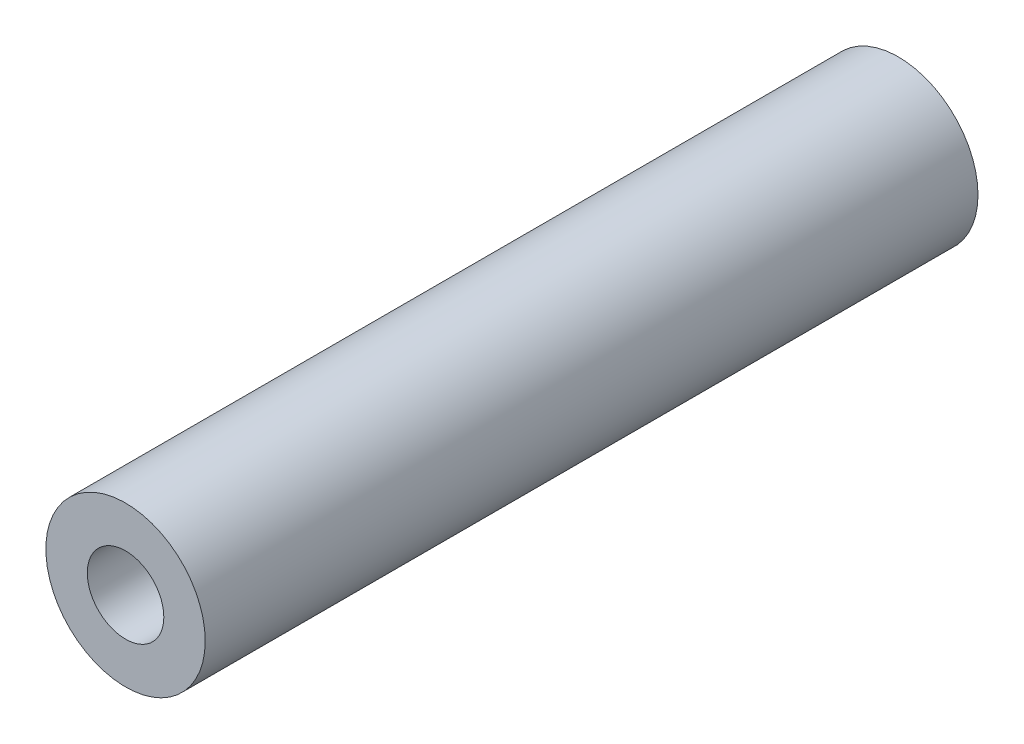
ISO-10303-21;
HEADER;
FILE_DESCRIPTION(('STEP AP214'),'2;1');
FILE_NAME('part.step','',(''),(''),'','','');
FILE_SCHEMA(('AUTOMOTIVE_DESIGN { 1 0 10303 214 1 1 1 1 }'));
ENDSEC;
DATA;
#1=APPLICATION_CONTEXT('core data for automotive mechanical design processes');
#2=APPLICATION_PROTOCOL_DEFINITION('international standard','automotive_design',2000,#1);
#3=PRODUCT_CONTEXT('',#1,'mechanical');
#4=PRODUCT('Part','Part','',(#3));
#5=PRODUCT_RELATED_PRODUCT_CATEGORY('part','',(#4));
#6=PRODUCT_DEFINITION_FORMATION('','',#4);
#7=PRODUCT_DEFINITION_CONTEXT('part definition',#1,'design');
#8=PRODUCT_DEFINITION('design','',#6,#7);
#9=PRODUCT_DEFINITION_SHAPE('','',#8);
#10=(LENGTH_UNIT() NAMED_UNIT(*) SI_UNIT(.MILLI.,.METRE.));
#11=(NAMED_UNIT(*) PLANE_ANGLE_UNIT() SI_UNIT($,.RADIAN.));
#12=(NAMED_UNIT(*) SI_UNIT($,.STERADIAN.) SOLID_ANGLE_UNIT());
#13=UNCERTAINTY_MEASURE_WITH_UNIT(LENGTH_MEASURE(1.E-05),#10,'distance_accuracy_value','');
#14=(GEOMETRIC_REPRESENTATION_CONTEXT(3) GLOBAL_UNCERTAINTY_ASSIGNED_CONTEXT((#13)) GLOBAL_UNIT_ASSIGNED_CONTEXT((#10,
#11,#12)) REPRESENTATION_CONTEXT('',''));
#15=CARTESIAN_POINT('',(0.,0.,0.));
#16=DIRECTION('',(0.,0.,1.));
#17=DIRECTION('',(1.,0.,0.));
#18=AXIS2_PLACEMENT_3D('',#15,#16,#17);
#19=CARTESIAN_POINT('',(-7.72417102966841,4.70986038394415,2.5));
#20=DIRECTION('',(0.,0.,-1.));
#21=DIRECTION('',(-1.,0.,0.));
#22=AXIS2_PLACEMENT_3D('',#19,#20,#21);
#23=CYLINDRICAL_SURFACE('',#22,0.25781);
#24=CARTESIAN_POINT('',(-7.72417102966841,4.70986038394415,2.5));
#25=DIRECTION('',(0.,0.,1.));
#26=DIRECTION('',(1.,0.,0.));
#27=AXIS2_PLACEMENT_3D('',#24,#25,#26);
#28=CIRCLE('',#27,0.25781);
#29=CARTESIAN_POINT('',(-7.46636102966841,4.70986038394415,2.5));
#30=VERTEX_POINT('',#29);
#31=EDGE_CURVE('E10',#30,#30,#28,.T.);
#32=ORIENTED_EDGE('',*,*,#31,.F.);
#33=EDGE_LOOP('',(#32));
#34=FACE_BOUND('',#33,.T.);
#35=CARTESIAN_POINT('',(-7.72417102966841,4.70986038394415,0.));
#36=DIRECTION('',(0.,0.,1.));
#37=DIRECTION('',(1.,0.,0.));
#38=AXIS2_PLACEMENT_3D('',#35,#36,#37);
#39=CIRCLE('',#38,0.25781);
#40=CARTESIAN_POINT('',(-7.46636102966841,4.70986038394415,0.));
#41=VERTEX_POINT('',#40);
#42=EDGE_CURVE('E33',#41,#41,#39,.T.);
#43=ORIENTED_EDGE('',*,*,#42,.T.);
#44=EDGE_LOOP('',(#43));
#45=FACE_BOUND('',#44,.T.);
#46=ADVANCED_FACE('F30',(#34,#45),#23,.T.);
#47=CARTESIAN_POINT('',(-7.72417102966841,4.70986038394415,2.5));
#48=DIRECTION('',(0.,0.,1.));
#49=DIRECTION('',(1.,0.,0.));
#50=AXIS2_PLACEMENT_3D('',#47,#48,#49);
#51=PLANE('',#50);
#52=CARTESIAN_POINT('',(-7.72417102966841,4.70986038394415,2.5));
#53=DIRECTION('',(0.,0.,1.));
#54=DIRECTION('',(1.,0.,0.));
#55=AXIS2_PLACEMENT_3D('',#52,#53,#54);
#56=CIRCLE('',#55,0.123825);
#57=CARTESIAN_POINT('',(-7.60034602966841,4.70986038394415,2.5));
#58=VERTEX_POINT('',#57);
#59=EDGE_CURVE('E42',#58,#58,#56,.T.);
#60=ORIENTED_EDGE('',*,*,#59,.F.);
#61=EDGE_LOOP('',(#60));
#62=FACE_BOUND('',#61,.T.);
#63=ORIENTED_EDGE('',*,*,#31,.T.);
#64=EDGE_LOOP('',(#63));
#65=FACE_BOUND('',#64,.T.);
#66=ADVANCED_FACE('F57',(#62,#65),#51,.T.);
#67=CARTESIAN_POINT('',(-7.72417102966841,4.70986038394415,0.));
#68=DIRECTION('',(0.,0.,1.));
#69=DIRECTION('',(1.,0.,0.));
#70=AXIS2_PLACEMENT_3D('',#67,#68,#69);
#71=PLANE('',#70);
#72=CARTESIAN_POINT('',(-7.72417102966841,4.70986038394415,0.));
#73=DIRECTION('',(0.,0.,1.));
#74=DIRECTION('',(1.,0.,0.));
#75=AXIS2_PLACEMENT_3D('',#72,#73,#74);
#76=CIRCLE('',#75,0.123825);
#77=CARTESIAN_POINT('',(-7.60034602966841,4.70986038394415,0.));
#78=VERTEX_POINT('',#77);
#79=EDGE_CURVE('E40',#78,#78,#76,.T.);
#80=ORIENTED_EDGE('',*,*,#79,.T.);
#81=EDGE_LOOP('',(#80));
#82=FACE_BOUND('',#81,.T.);
#83=ORIENTED_EDGE('',*,*,#42,.F.);
#84=EDGE_LOOP('',(#83));
#85=FACE_BOUND('',#84,.T.);
#86=ADVANCED_FACE('F48',(#82,#85),#71,.F.);
#87=CARTESIAN_POINT('',(-7.72417102966841,4.70986038394415,0.));
#88=DIRECTION('',(0.,0.,1.));
#89=DIRECTION('',(1.,0.,0.));
#90=AXIS2_PLACEMENT_3D('',#87,#88,#89);
#91=CYLINDRICAL_SURFACE('',#90,0.123825);
#92=ORIENTED_EDGE('',*,*,#79,.F.);
#93=EDGE_LOOP('',(#92));
#94=FACE_BOUND('',#93,.T.);
#95=ORIENTED_EDGE('',*,*,#59,.T.);
#96=EDGE_LOOP('',(#95));
#97=FACE_BOUND('',#96,.T.);
#98=ADVANCED_FACE('F51',(#94,#97),#91,.F.);
#99=CLOSED_SHELL('',(#46,#66,#86,#98));
#100=MANIFOLD_SOLID_BREP('B2',#99);
#101=ADVANCED_BREP_SHAPE_REPRESENTATION('',(#18,#100),#14);
#102=SHAPE_DEFINITION_REPRESENTATION(#9,#101);
ENDSEC;
END-ISO-10303-21;
